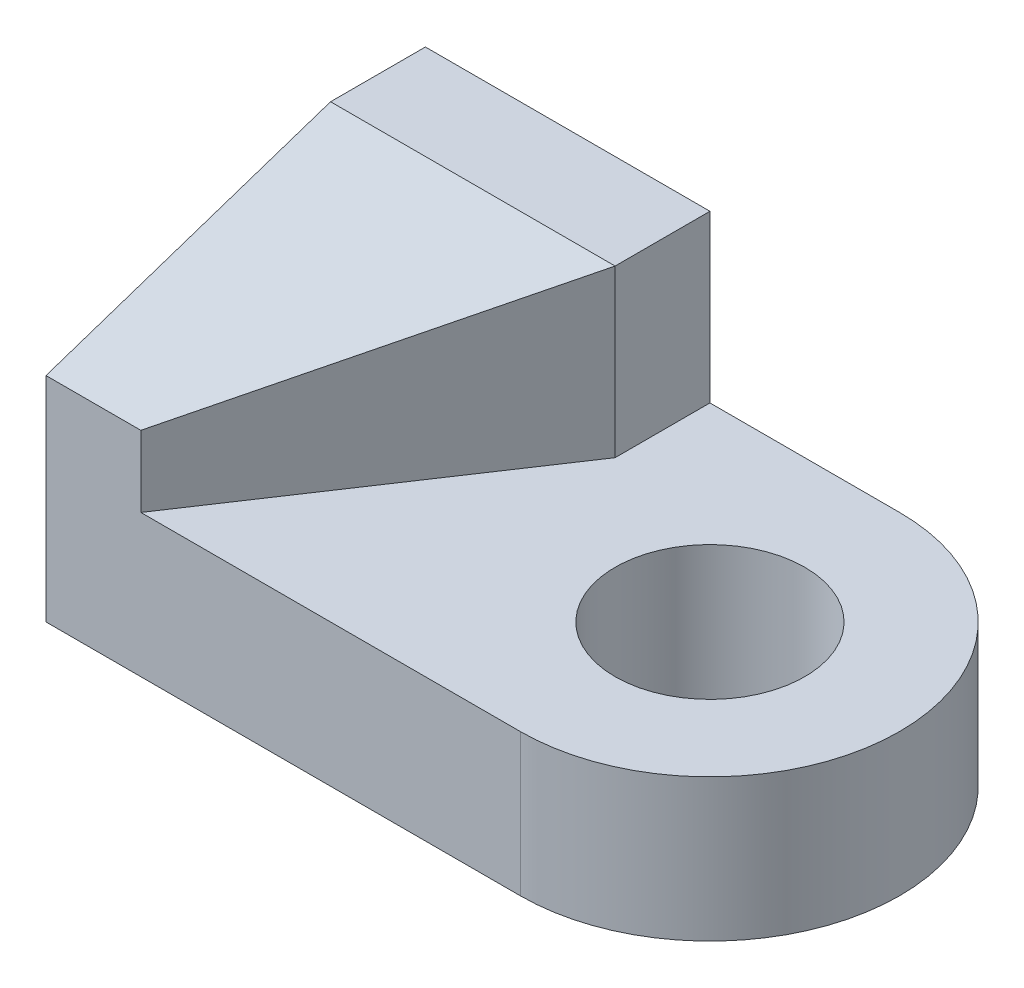
ISO-10303-21;
HEADER;
FILE_DESCRIPTION(('STEP AP214'),'2;1');
FILE_NAME('part.step','',(''),(''),'','','');
FILE_SCHEMA(('AUTOMOTIVE_DESIGN { 1 0 10303 214 1 1 1 1 }'));
ENDSEC;
DATA;
#1=APPLICATION_CONTEXT('core data for automotive mechanical design processes');
#2=APPLICATION_PROTOCOL_DEFINITION('international standard','automotive_design',2000,#1);
#3=PRODUCT_CONTEXT('',#1,'mechanical');
#4=PRODUCT('Part','Part','',(#3));
#5=PRODUCT_RELATED_PRODUCT_CATEGORY('part','',(#4));
#6=PRODUCT_DEFINITION_FORMATION('','',#4);
#7=PRODUCT_DEFINITION_CONTEXT('part definition',#1,'design');
#8=PRODUCT_DEFINITION('design','',#6,#7);
#9=PRODUCT_DEFINITION_SHAPE('','',#8);
#10=(LENGTH_UNIT() NAMED_UNIT(*) SI_UNIT(.MILLI.,.METRE.));
#11=(NAMED_UNIT(*) PLANE_ANGLE_UNIT() SI_UNIT($,.RADIAN.));
#12=(NAMED_UNIT(*) SI_UNIT($,.STERADIAN.) SOLID_ANGLE_UNIT());
#13=UNCERTAINTY_MEASURE_WITH_UNIT(LENGTH_MEASURE(1.E-05),#10,'distance_accuracy_value','');
#14=(GEOMETRIC_REPRESENTATION_CONTEXT(3) GLOBAL_UNCERTAINTY_ASSIGNED_CONTEXT((#13)) GLOBAL_UNIT_ASSIGNED_CONTEXT((#10,
#11,#12)) REPRESENTATION_CONTEXT('',''));
#15=CARTESIAN_POINT('',(0.,0.,0.));
#16=DIRECTION('',(0.,0.,1.));
#17=DIRECTION('',(1.,0.,0.));
#18=AXIS2_PLACEMENT_3D('',#15,#16,#17);
#19=CARTESIAN_POINT('',(0.,7.5,0.));
#20=DIRECTION('',(0.,1.,0.));
#21=DIRECTION('',(0.,0.,1.));
#22=AXIS2_PLACEMENT_3D('',#19,#20,#21);
#23=PLANE('',#22);
#24=CARTESIAN_POINT('',(50.,7.5,-20.));
#25=DIRECTION('',(0.,1.,0.));
#26=DIRECTION('',(0.,0.,1.));
#27=AXIS2_PLACEMENT_3D('',#24,#25,#26);
#28=CIRCLE('',#27,10.);
#29=CARTESIAN_POINT('',(50.,7.5,-10.));
#30=VERTEX_POINT('',#29);
#31=EDGE_CURVE('E94',#30,#30,#28,.T.);
#32=ORIENTED_EDGE('',*,*,#31,.F.);
#33=EDGE_LOOP('',(#32));
#34=FACE_BOUND('',#33,.T.);
#35=DIRECTION('',(0.,0.,1.));
#36=VECTOR('',#35,1.);
#37=CARTESIAN_POINT('',(30.,7.5,0.));
#38=LINE('',#37,#36);
#39=CARTESIAN_POINT('',(30.,7.5,-40.));
#40=VERTEX_POINT('',#39);
#41=CARTESIAN_POINT('',(30.,7.5,-30.));
#42=VERTEX_POINT('',#41);
#43=EDGE_CURVE('E11',#40,#42,#38,.T.);
#44=ORIENTED_EDGE('',*,*,#43,.T.);
#45=DIRECTION('',(-0.554700196225229,0.,0.832050294337844));
#46=VECTOR('',#45,1.);
#47=CARTESIAN_POINT('',(6.92307692307692,7.5,4.61538461538462));
#48=LINE('',#47,#46);
#49=CARTESIAN_POINT('',(10.,7.5,0.));
#50=VERTEX_POINT('',#49);
#51=EDGE_CURVE('E176',#42,#50,#48,.T.);
#52=ORIENTED_EDGE('',*,*,#51,.T.);
#53=DIRECTION('',(-1.,0.,0.));
#54=VECTOR('',#53,1.);
#55=CARTESIAN_POINT('',(0.,7.5,0.));
#56=LINE('',#55,#54);
#57=CARTESIAN_POINT('',(50.,7.5,0.));
#58=VERTEX_POINT('',#57);
#59=EDGE_CURVE('E153',#58,#50,#56,.T.);
#60=ORIENTED_EDGE('',*,*,#59,.F.);
#61=CARTESIAN_POINT('',(50.,7.5,-20.));
#62=DIRECTION('',(0.,1.,0.));
#63=DIRECTION('',(0.,0.,1.));
#64=AXIS2_PLACEMENT_3D('',#61,#62,#63);
#65=CIRCLE('',#64,20.);
#66=CARTESIAN_POINT('',(50.,7.5,-40.));
#67=VERTEX_POINT('',#66);
#68=EDGE_CURVE('E157',#58,#67,#65,.T.);
#69=ORIENTED_EDGE('',*,*,#68,.T.);
#70=DIRECTION('',(1.,0.,0.));
#71=VECTOR('',#70,1.);
#72=CARTESIAN_POINT('',(0.,7.5,-40.));
#73=LINE('',#72,#71);
#74=EDGE_CURVE('E57',#40,#67,#73,.T.);
#75=ORIENTED_EDGE('',*,*,#74,.F.);
#76=EDGE_LOOP('',(#44,#52,#60,#69,#75));
#77=FACE_BOUND('',#76,.T.);
#78=ADVANCED_FACE('F39',(#34,#77),#23,.T.);
#79=CARTESIAN_POINT('',(0.,7.5,-40.));
#80=DIRECTION('',(0.,0.,-1.));
#81=DIRECTION('',(-1.,0.,0.));
#82=AXIS2_PLACEMENT_3D('',#79,#80,#81);
#83=PLANE('',#82);
#84=DIRECTION('',(0.,-1.,0.));
#85=VECTOR('',#84,1.);
#86=CARTESIAN_POINT('',(50.,7.5,-40.));
#87=LINE('',#86,#85);
#88=CARTESIAN_POINT('',(50.,-7.5,-40.));
#89=VERTEX_POINT('',#88);
#90=EDGE_CURVE('E92',#67,#89,#87,.T.);
#91=ORIENTED_EDGE('',*,*,#90,.T.);
#92=DIRECTION('',(1.,0.,0.));
#93=VECTOR('',#92,1.);
#94=CARTESIAN_POINT('',(0.,-7.5,-40.));
#95=LINE('',#94,#93);
#96=CARTESIAN_POINT('',(0.,-7.5,-40.));
#97=VERTEX_POINT('',#96);
#98=EDGE_CURVE('E80',#97,#89,#95,.T.);
#99=ORIENTED_EDGE('',*,*,#98,.F.);
#100=DIRECTION('',(0.,-1.,0.));
#101=VECTOR('',#100,1.);
#102=CARTESIAN_POINT('',(0.,7.5,-40.));
#103=LINE('',#102,#101);
#104=CARTESIAN_POINT('',(0.,25.,-40.));
#105=VERTEX_POINT('',#104);
#106=EDGE_CURVE('E49',#105,#97,#103,.T.);
#107=ORIENTED_EDGE('',*,*,#106,.F.);
#108=DIRECTION('',(1.,0.,0.));
#109=VECTOR('',#108,1.);
#110=CARTESIAN_POINT('',(0.,25.,-40.));
#111=LINE('',#110,#109);
#112=CARTESIAN_POINT('',(30.,25.,-40.));
#113=VERTEX_POINT('',#112);
#114=EDGE_CURVE('E125',#105,#113,#111,.T.);
#115=ORIENTED_EDGE('',*,*,#114,.T.);
#116=DIRECTION('',(0.,-1.,0.));
#117=VECTOR('',#116,1.);
#118=CARTESIAN_POINT('',(30.,25.,-40.));
#119=LINE('',#118,#117);
#120=EDGE_CURVE('E140',#113,#40,#119,.T.);
#121=ORIENTED_EDGE('',*,*,#120,.T.);
#122=ORIENTED_EDGE('',*,*,#74,.T.);
#123=EDGE_LOOP('',(#91,#99,#107,#115,#121,#122));
#124=FACE_BOUND('',#123,.T.);
#125=ADVANCED_FACE('F41',(#124),#83,.T.);
#126=CARTESIAN_POINT('',(0.,7.5,0.));
#127=DIRECTION('',(-1.,0.,0.));
#128=DIRECTION('',(0.,0.,1.));
#129=AXIS2_PLACEMENT_3D('',#126,#127,#128);
#130=PLANE('',#129);
#131=DIRECTION('',(0.,-1.,0.));
#132=VECTOR('',#131,1.);
#133=CARTESIAN_POINT('',(0.,7.5,0.));
#134=LINE('',#133,#132);
#135=CARTESIAN_POINT('',(0.,15.,0.));
#136=VERTEX_POINT('',#135);
#137=CARTESIAN_POINT('',(0.,-7.5,0.));
#138=VERTEX_POINT('',#137);
#139=EDGE_CURVE('E110',#136,#138,#134,.T.);
#140=ORIENTED_EDGE('',*,*,#139,.F.);
#141=DIRECTION('',(0.,-0.316227766016838,0.948683298050514));
#142=VECTOR('',#141,1.);
#143=CARTESIAN_POINT('',(0.,25.,-30.));
#144=LINE('',#143,#142);
#145=CARTESIAN_POINT('',(0.,25.,-30.));
#146=VERTEX_POINT('',#145);
#147=EDGE_CURVE('E187',#146,#136,#144,.T.);
#148=ORIENTED_EDGE('',*,*,#147,.F.);
#149=DIRECTION('',(0.,0.,-1.));
#150=VECTOR('',#149,1.);
#151=CARTESIAN_POINT('',(0.,25.,0.));
#152=LINE('',#151,#150);
#153=EDGE_CURVE('E121',#146,#105,#152,.T.);
#154=ORIENTED_EDGE('',*,*,#153,.T.);
#155=ORIENTED_EDGE('',*,*,#106,.T.);
#156=DIRECTION('',(0.,0.,-1.));
#157=VECTOR('',#156,1.);
#158=CARTESIAN_POINT('',(0.,-7.5,0.));
#159=LINE('',#158,#157);
#160=EDGE_CURVE('E86',#138,#97,#159,.T.);
#161=ORIENTED_EDGE('',*,*,#160,.F.);
#162=EDGE_LOOP('',(#140,#148,#154,#155,#161));
#163=FACE_BOUND('',#162,.T.);
#164=ADVANCED_FACE('F117',(#163),#130,.T.);
#165=CARTESIAN_POINT('',(0.,7.5,0.));
#166=DIRECTION('',(0.,0.,1.));
#167=DIRECTION('',(1.,0.,0.));
#168=AXIS2_PLACEMENT_3D('',#165,#166,#167);
#169=PLANE('',#168);
#170=ORIENTED_EDGE('',*,*,#59,.T.);
#171=DIRECTION('',(0.,-1.,0.));
#172=VECTOR('',#171,1.);
#173=CARTESIAN_POINT('',(10.,15.,0.));
#174=LINE('',#173,#172);
#175=CARTESIAN_POINT('',(10.,15.,0.));
#176=VERTEX_POINT('',#175);
#177=EDGE_CURVE('E185',#176,#50,#174,.T.);
#178=ORIENTED_EDGE('',*,*,#177,.F.);
#179=DIRECTION('',(-1.,0.,0.));
#180=VECTOR('',#179,1.);
#181=CARTESIAN_POINT('',(10.,15.,0.));
#182=LINE('',#181,#180);
#183=EDGE_CURVE('E198',#176,#136,#182,.T.);
#184=ORIENTED_EDGE('',*,*,#183,.T.);
#185=ORIENTED_EDGE('',*,*,#139,.T.);
#186=DIRECTION('',(-1.,0.,0.));
#187=VECTOR('',#186,1.);
#188=CARTESIAN_POINT('',(0.,-7.5,0.));
#189=LINE('',#188,#187);
#190=CARTESIAN_POINT('',(50.,-7.5,0.));
#191=VERTEX_POINT('',#190);
#192=EDGE_CURVE('E99',#191,#138,#189,.T.);
#193=ORIENTED_EDGE('',*,*,#192,.F.);
#194=DIRECTION('',(0.,-1.,0.));
#195=VECTOR('',#194,1.);
#196=CARTESIAN_POINT('',(50.,7.5,0.));
#197=LINE('',#196,#195);
#198=EDGE_CURVE('E74',#58,#191,#197,.T.);
#199=ORIENTED_EDGE('',*,*,#198,.F.);
#200=EDGE_LOOP('',(#170,#178,#184,#185,#193,#199));
#201=FACE_BOUND('',#200,.T.);
#202=ADVANCED_FACE('F218',(#201),#169,.T.);
#203=CARTESIAN_POINT('',(50.,7.5,-20.));
#204=DIRECTION('',(0.,-1.,0.));
#205=DIRECTION('',(0.,0.,-1.));
#206=AXIS2_PLACEMENT_3D('',#203,#204,#205);
#207=CYLINDRICAL_SURFACE('',#206,20.);
#208=CARTESIAN_POINT('',(50.,-7.5,-20.));
#209=DIRECTION('',(0.,1.,0.));
#210=DIRECTION('',(0.,0.,1.));
#211=AXIS2_PLACEMENT_3D('',#208,#209,#210);
#212=CIRCLE('',#211,20.);
#213=EDGE_CURVE('E83',#191,#89,#212,.T.);
#214=ORIENTED_EDGE('',*,*,#213,.T.);
#215=ORIENTED_EDGE('',*,*,#90,.F.);
#216=ORIENTED_EDGE('',*,*,#68,.F.);
#217=ORIENTED_EDGE('',*,*,#198,.T.);
#218=EDGE_LOOP('',(#214,#215,#216,#217));
#219=FACE_BOUND('',#218,.T.);
#220=ADVANCED_FACE('F96',(#219),#207,.T.);
#221=CARTESIAN_POINT('',(50.,7.5,-20.));
#222=DIRECTION('',(0.,-1.,0.));
#223=DIRECTION('',(0.,0.,-1.));
#224=AXIS2_PLACEMENT_3D('',#221,#222,#223);
#225=CYLINDRICAL_SURFACE('',#224,10.);
#226=ORIENTED_EDGE('',*,*,#31,.T.);
#227=EDGE_LOOP('',(#226));
#228=FACE_BOUND('',#227,.T.);
#229=CARTESIAN_POINT('',(50.,-7.5,-20.));
#230=DIRECTION('',(0.,1.,0.));
#231=DIRECTION('',(0.,0.,1.));
#232=AXIS2_PLACEMENT_3D('',#229,#230,#231);
#233=CIRCLE('',#232,10.);
#234=CARTESIAN_POINT('',(50.,-7.5,-10.));
#235=VERTEX_POINT('',#234);
#236=EDGE_CURVE('E98',#235,#235,#233,.T.);
#237=ORIENTED_EDGE('',*,*,#236,.F.);
#238=EDGE_LOOP('',(#237));
#239=FACE_BOUND('',#238,.T.);
#240=ADVANCED_FACE('F165',(#228,#239),#225,.F.);
#241=CARTESIAN_POINT('',(0.,-7.5,0.));
#242=DIRECTION('',(0.,1.,0.));
#243=DIRECTION('',(0.,0.,1.));
#244=AXIS2_PLACEMENT_3D('',#241,#242,#243);
#245=PLANE('',#244);
#246=ORIENTED_EDGE('',*,*,#192,.T.);
#247=ORIENTED_EDGE('',*,*,#160,.T.);
#248=ORIENTED_EDGE('',*,*,#98,.T.);
#249=ORIENTED_EDGE('',*,*,#213,.F.);
#250=EDGE_LOOP('',(#246,#247,#248,#249));
#251=FACE_BOUND('',#250,.T.);
#252=ORIENTED_EDGE('',*,*,#236,.T.);
#253=EDGE_LOOP('',(#252));
#254=FACE_BOUND('',#253,.T.);
#255=ADVANCED_FACE('F81',(#251,#254),#245,.F.);
#256=CARTESIAN_POINT('',(30.,25.,0.));
#257=DIRECTION('',(-1.,0.,0.));
#258=DIRECTION('',(0.,0.,1.));
#259=AXIS2_PLACEMENT_3D('',#256,#257,#258);
#260=PLANE('',#259);
#261=ORIENTED_EDGE('',*,*,#43,.F.);
#262=ORIENTED_EDGE('',*,*,#120,.F.);
#263=DIRECTION('',(0.,0.,-1.));
#264=VECTOR('',#263,1.);
#265=CARTESIAN_POINT('',(30.,25.,0.));
#266=LINE('',#265,#264);
#267=CARTESIAN_POINT('',(30.,25.,-30.));
#268=VERTEX_POINT('',#267);
#269=EDGE_CURVE('E134',#268,#113,#266,.T.);
#270=ORIENTED_EDGE('',*,*,#269,.F.);
#271=DIRECTION('',(0.,-1.,0.));
#272=VECTOR('',#271,1.);
#273=CARTESIAN_POINT('',(30.,25.,-30.));
#274=LINE('',#273,#272);
#275=EDGE_CURVE('E89',#268,#42,#274,.T.);
#276=ORIENTED_EDGE('',*,*,#275,.T.);
#277=EDGE_LOOP('',(#261,#262,#270,#276));
#278=FACE_BOUND('',#277,.T.);
#279=ADVANCED_FACE('F207',(#278),#260,.F.);
#280=CARTESIAN_POINT('',(0.,25.,0.));
#281=DIRECTION('',(0.,1.,0.));
#282=DIRECTION('',(0.,0.,1.));
#283=AXIS2_PLACEMENT_3D('',#280,#281,#282);
#284=PLANE('',#283);
#285=ORIENTED_EDGE('',*,*,#269,.T.);
#286=ORIENTED_EDGE('',*,*,#114,.F.);
#287=ORIENTED_EDGE('',*,*,#153,.F.);
#288=DIRECTION('',(1.,0.,0.));
#289=VECTOR('',#288,1.);
#290=CARTESIAN_POINT('',(0.,25.,-30.));
#291=LINE('',#290,#289);
#292=EDGE_CURVE('E142',#146,#268,#291,.T.);
#293=ORIENTED_EDGE('',*,*,#292,.T.);
#294=EDGE_LOOP('',(#285,#286,#287,#293));
#295=FACE_BOUND('',#294,.T.);
#296=ADVANCED_FACE('F130',(#295),#284,.T.);
#297=CARTESIAN_POINT('',(10.,25.,-30.));
#298=DIRECTION('',(0.,-0.948683298050514,-0.316227766016838));
#299=DIRECTION('',(0.,0.316227766016838,-0.948683298050514));
#300=AXIS2_PLACEMENT_3D('',#297,#298,#299);
#301=PLANE('',#300);
#302=ORIENTED_EDGE('',*,*,#147,.T.);
#303=ORIENTED_EDGE('',*,*,#183,.F.);
#304=DIRECTION('',(0.534522483824849,0.267261241912424,-0.801783725737273));
#305=VECTOR('',#304,1.);
#306=CARTESIAN_POINT('',(-0.390247194972354,9.80487640251383,15.5853707924585));
#307=LINE('',#306,#305);
#308=EDGE_CURVE('E188',#176,#268,#307,.T.);
#309=ORIENTED_EDGE('',*,*,#308,.T.);
#310=ORIENTED_EDGE('',*,*,#292,.F.);
#311=EDGE_LOOP('',(#302,#303,#309,#310));
#312=FACE_BOUND('',#311,.T.);
#313=ADVANCED_FACE('F209',(#312),#301,.F.);
#314=CARTESIAN_POINT('',(-0.390247194972354,-7.69512359748618,15.5853707924585));
#315=DIRECTION('',(-0.832050294337844,0.,-0.554700196225229));
#316=DIRECTION('',(-0.554700196225229,0.,0.832050294337844));
#317=AXIS2_PLACEMENT_3D('',#314,#315,#316);
#318=PLANE('',#317);
#319=ORIENTED_EDGE('',*,*,#51,.F.);
#320=ORIENTED_EDGE('',*,*,#275,.F.);
#321=ORIENTED_EDGE('',*,*,#308,.F.);
#322=ORIENTED_EDGE('',*,*,#177,.T.);
#323=EDGE_LOOP('',(#319,#320,#321,#322));
#324=FACE_BOUND('',#323,.T.);
#325=ADVANCED_FACE('F181',(#324),#318,.F.);
#326=CLOSED_SHELL('',(#78,#125,#164,#202,#220,#240,#255,#279,#296,#313,#325));
#327=MANIFOLD_SOLID_BREP('B2',#326);
#328=ADVANCED_BREP_SHAPE_REPRESENTATION('',(#18,#327),#14);
#329=SHAPE_DEFINITION_REPRESENTATION(#9,#328);
ENDSEC;
END-ISO-10303-21;
